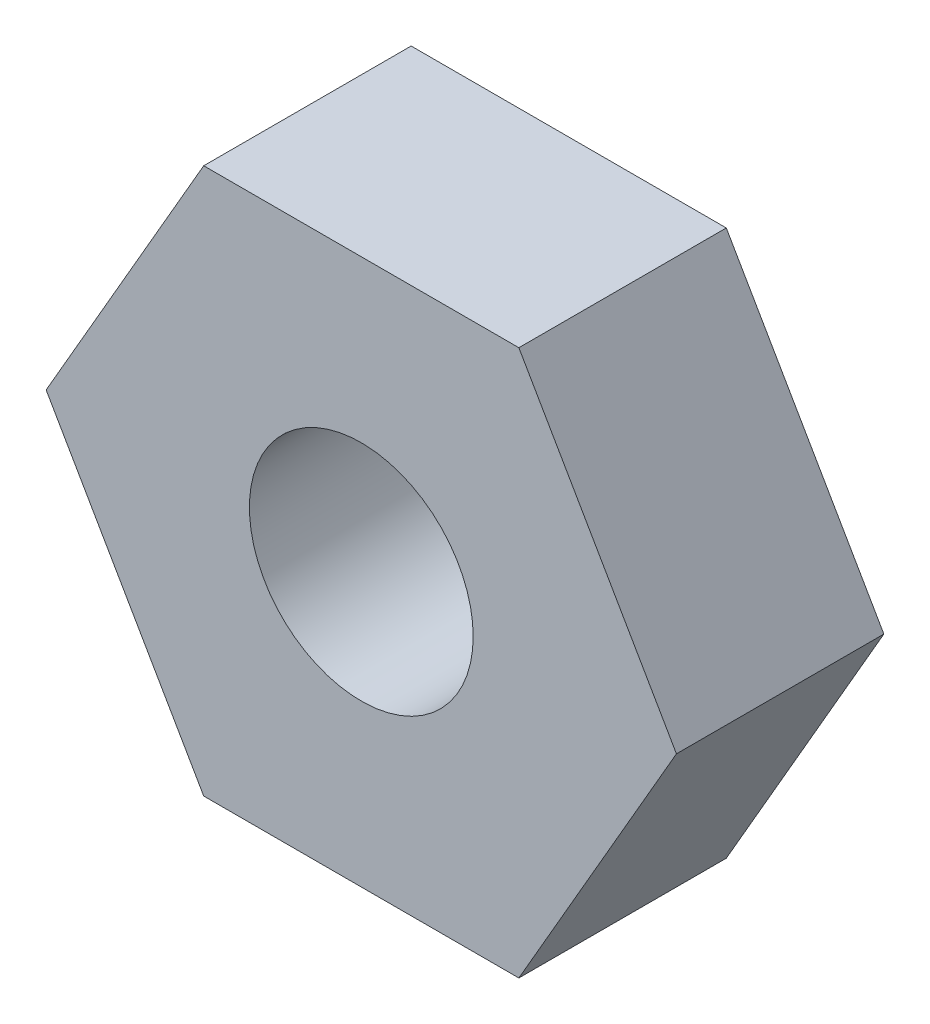
ISO-10303-21;
HEADER;
FILE_DESCRIPTION(('STEP AP214'),'2;1');
FILE_NAME('part.step','',(''),(''),'','','');
FILE_SCHEMA(('AUTOMOTIVE_DESIGN { 1 0 10303 214 1 1 1 1 }'));
ENDSEC;
DATA;
#1=APPLICATION_CONTEXT('core data for automotive mechanical design processes');
#2=APPLICATION_PROTOCOL_DEFINITION('international standard','automotive_design',2000,#1);
#3=PRODUCT_CONTEXT('',#1,'mechanical');
#4=PRODUCT('Part','Part','',(#3));
#5=PRODUCT_RELATED_PRODUCT_CATEGORY('part','',(#4));
#6=PRODUCT_DEFINITION_FORMATION('','',#4);
#7=PRODUCT_DEFINITION_CONTEXT('part definition',#1,'design');
#8=PRODUCT_DEFINITION('design','',#6,#7);
#9=PRODUCT_DEFINITION_SHAPE('','',#8);
#10=(LENGTH_UNIT() NAMED_UNIT(*) SI_UNIT(.MILLI.,.METRE.));
#11=(NAMED_UNIT(*) PLANE_ANGLE_UNIT() SI_UNIT($,.RADIAN.));
#12=(NAMED_UNIT(*) SI_UNIT($,.STERADIAN.) SOLID_ANGLE_UNIT());
#13=UNCERTAINTY_MEASURE_WITH_UNIT(LENGTH_MEASURE(1.E-05),#10,'distance_accuracy_value','');
#14=(GEOMETRIC_REPRESENTATION_CONTEXT(3) GLOBAL_UNCERTAINTY_ASSIGNED_CONTEXT((#13)) GLOBAL_UNIT_ASSIGNED_CONTEXT((#10,
#11,#12)) REPRESENTATION_CONTEXT('',''));
#15=CARTESIAN_POINT('',(0.,0.,0.));
#16=DIRECTION('',(0.,0.,1.));
#17=DIRECTION('',(1.,0.,0.));
#18=AXIS2_PLACEMENT_3D('',#15,#16,#17);
#19=CARTESIAN_POINT('',(-1.44337567297409,2.49999999999998,1.9));
#20=DIRECTION('',(0.866025403784441,-0.499999999999995,0.));
#21=DIRECTION('',(0.499999999999995,0.866025403784442,0.));
#22=AXIS2_PLACEMENT_3D('',#19,#20,#21);
#23=PLANE('',#22);
#24=DIRECTION('',(-0.499999999999995,-0.866025403784442,0.));
#25=VECTOR('',#24,1.);
#26=CARTESIAN_POINT('',(-1.44337567297409,2.49999999999998,0.));
#27=LINE('',#26,#25);
#28=CARTESIAN_POINT('',(-1.44337567297409,2.49999999999998,0.));
#29=VERTEX_POINT('',#28);
#30=CARTESIAN_POINT('',(-2.88675134594813,0.,0.));
#31=VERTEX_POINT('',#30);
#32=EDGE_CURVE('E125',#29,#31,#27,.T.);
#33=ORIENTED_EDGE('',*,*,#32,.T.);
#34=DIRECTION('',(0.,0.,-1.));
#35=VECTOR('',#34,1.);
#36=CARTESIAN_POINT('',(-2.88675134594813,0.,1.9));
#37=LINE('',#36,#35);
#38=CARTESIAN_POINT('',(-2.88675134594813,0.,1.9));
#39=VERTEX_POINT('',#38);
#40=EDGE_CURVE('E11',#39,#31,#37,.T.);
#41=ORIENTED_EDGE('',*,*,#40,.F.);
#42=DIRECTION('',(-0.499999999999995,-0.866025403784442,0.));
#43=VECTOR('',#42,1.);
#44=CARTESIAN_POINT('',(-1.44337567297409,2.49999999999998,1.9));
#45=LINE('',#44,#43);
#46=CARTESIAN_POINT('',(-1.44337567297409,2.49999999999998,1.9));
#47=VERTEX_POINT('',#46);
#48=EDGE_CURVE('E136',#47,#39,#45,.T.);
#49=ORIENTED_EDGE('',*,*,#48,.F.);
#50=DIRECTION('',(0.,0.,-1.));
#51=VECTOR('',#50,1.);
#52=CARTESIAN_POINT('',(-1.44337567297409,2.49999999999998,1.9));
#53=LINE('',#52,#51);
#54=EDGE_CURVE('E121',#47,#29,#53,.T.);
#55=ORIENTED_EDGE('',*,*,#54,.T.);
#56=EDGE_LOOP('',(#33,#41,#49,#55));
#57=FACE_BOUND('',#56,.T.);
#58=ADVANCED_FACE('F41',(#57),#23,.F.);
#59=CARTESIAN_POINT('',(-2.88675134594813,0.,1.9));
#60=DIRECTION('',(0.866025403784438,0.500000000000001,0.));
#61=DIRECTION('',(-0.500000000000001,0.866025403784438,0.));
#62=AXIS2_PLACEMENT_3D('',#59,#60,#61);
#63=PLANE('',#62);
#64=DIRECTION('',(0.500000000000001,-0.866025403784438,0.));
#65=VECTOR('',#64,1.);
#66=CARTESIAN_POINT('',(-2.88675134594813,0.,0.));
#67=LINE('',#66,#65);
#68=CARTESIAN_POINT('',(-1.44337567297406,-2.50000000000001,0.));
#69=VERTEX_POINT('',#68);
#70=EDGE_CURVE('E128',#31,#69,#67,.T.);
#71=ORIENTED_EDGE('',*,*,#70,.T.);
#72=DIRECTION('',(0.,0.,-1.));
#73=VECTOR('',#72,1.);
#74=CARTESIAN_POINT('',(-1.44337567297406,-2.50000000000001,1.9));
#75=LINE('',#74,#73);
#76=CARTESIAN_POINT('',(-1.44337567297406,-2.50000000000001,1.9));
#77=VERTEX_POINT('',#76);
#78=EDGE_CURVE('E49',#77,#69,#75,.T.);
#79=ORIENTED_EDGE('',*,*,#78,.F.);
#80=DIRECTION('',(0.500000000000001,-0.866025403784438,0.));
#81=VECTOR('',#80,1.);
#82=CARTESIAN_POINT('',(-2.88675134594813,0.,1.9));
#83=LINE('',#82,#81);
#84=EDGE_CURVE('E94',#39,#77,#83,.T.);
#85=ORIENTED_EDGE('',*,*,#84,.F.);
#86=ORIENTED_EDGE('',*,*,#40,.T.);
#87=EDGE_LOOP('',(#71,#79,#85,#86));
#88=FACE_BOUND('',#87,.T.);
#89=ADVANCED_FACE('F161',(#88),#63,.F.);
#90=CARTESIAN_POINT('',(-1.44337567297406,-2.50000000000001,1.9));
#91=DIRECTION('',(0.,1.,0.));
#92=DIRECTION('',(-1.,0.,0.));
#93=AXIS2_PLACEMENT_3D('',#90,#91,#92);
#94=PLANE('',#93);
#95=DIRECTION('',(1.,0.,0.));
#96=VECTOR('',#95,1.);
#97=CARTESIAN_POINT('',(-1.44337567297406,-2.50000000000001,0.));
#98=LINE('',#97,#96);
#99=CARTESIAN_POINT('',(1.44337567297408,-2.5,0.));
#100=VERTEX_POINT('',#99);
#101=EDGE_CURVE('E131',#69,#100,#98,.T.);
#102=ORIENTED_EDGE('',*,*,#101,.T.);
#103=DIRECTION('',(0.,0.,-1.));
#104=VECTOR('',#103,1.);
#105=CARTESIAN_POINT('',(1.44337567297408,-2.5,1.9));
#106=LINE('',#105,#104);
#107=CARTESIAN_POINT('',(1.44337567297408,-2.5,1.9));
#108=VERTEX_POINT('',#107);
#109=EDGE_CURVE('E116',#108,#100,#106,.T.);
#110=ORIENTED_EDGE('',*,*,#109,.F.);
#111=DIRECTION('',(1.,0.,0.));
#112=VECTOR('',#111,1.);
#113=CARTESIAN_POINT('',(-1.44337567297406,-2.50000000000001,1.9));
#114=LINE('',#113,#112);
#115=EDGE_CURVE('E107',#77,#108,#114,.T.);
#116=ORIENTED_EDGE('',*,*,#115,.F.);
#117=ORIENTED_EDGE('',*,*,#78,.T.);
#118=EDGE_LOOP('',(#102,#110,#116,#117));
#119=FACE_BOUND('',#118,.T.);
#120=ADVANCED_FACE('F142',(#119),#94,.F.);
#121=CARTESIAN_POINT('',(1.44337567297408,-2.5,1.9));
#122=DIRECTION('',(-0.866025403784442,0.499999999999995,0.));
#123=DIRECTION('',(-0.499999999999995,-0.866025403784442,0.));
#124=AXIS2_PLACEMENT_3D('',#121,#122,#123);
#125=PLANE('',#124);
#126=DIRECTION('',(0.499999999999995,0.866025403784442,0.));
#127=VECTOR('',#126,1.);
#128=CARTESIAN_POINT('',(1.44337567297408,-2.5,0.));
#129=LINE('',#128,#127);
#130=CARTESIAN_POINT('',(2.88675134594813,0.,0.));
#131=VERTEX_POINT('',#130);
#132=EDGE_CURVE('E115',#100,#131,#129,.T.);
#133=ORIENTED_EDGE('',*,*,#132,.T.);
#134=DIRECTION('',(0.,0.,-1.));
#135=VECTOR('',#134,1.);
#136=CARTESIAN_POINT('',(2.88675134594813,0.,1.9));
#137=LINE('',#136,#135);
#138=CARTESIAN_POINT('',(2.88675134594813,0.,1.9));
#139=VERTEX_POINT('',#138);
#140=EDGE_CURVE('E112',#139,#131,#137,.T.);
#141=ORIENTED_EDGE('',*,*,#140,.F.);
#142=DIRECTION('',(0.499999999999995,0.866025403784442,0.));
#143=VECTOR('',#142,1.);
#144=CARTESIAN_POINT('',(1.44337567297408,-2.5,1.9));
#145=LINE('',#144,#143);
#146=EDGE_CURVE('E101',#108,#139,#145,.T.);
#147=ORIENTED_EDGE('',*,*,#146,.F.);
#148=ORIENTED_EDGE('',*,*,#109,.T.);
#149=EDGE_LOOP('',(#133,#141,#147,#148));
#150=FACE_BOUND('',#149,.T.);
#151=ADVANCED_FACE('F113',(#150),#125,.F.);
#152=CARTESIAN_POINT('',(2.88675134594813,0.,1.9));
#153=DIRECTION('',(-0.866025403784435,-0.500000000000007,0.));
#154=DIRECTION('',(0.500000000000007,-0.866025403784435,0.));
#155=AXIS2_PLACEMENT_3D('',#152,#153,#154);
#156=PLANE('',#155);
#157=DIRECTION('',(-0.500000000000007,0.866025403784435,0.));
#158=VECTOR('',#157,1.);
#159=CARTESIAN_POINT('',(2.88675134594813,0.,0.));
#160=LINE('',#159,#158);
#161=CARTESIAN_POINT('',(1.44337567297404,2.50000000000002,0.));
#162=VERTEX_POINT('',#161);
#163=EDGE_CURVE('E80',#131,#162,#160,.T.);
#164=ORIENTED_EDGE('',*,*,#163,.T.);
#165=DIRECTION('',(0.,0.,-1.));
#166=VECTOR('',#165,1.);
#167=CARTESIAN_POINT('',(1.44337567297404,2.50000000000002,1.9));
#168=LINE('',#167,#166);
#169=CARTESIAN_POINT('',(1.44337567297404,2.50000000000002,1.9));
#170=VERTEX_POINT('',#169);
#171=EDGE_CURVE('E117',#170,#162,#168,.T.);
#172=ORIENTED_EDGE('',*,*,#171,.F.);
#173=DIRECTION('',(-0.500000000000007,0.866025403784435,0.));
#174=VECTOR('',#173,1.);
#175=CARTESIAN_POINT('',(2.88675134594813,0.,1.9));
#176=LINE('',#175,#174);
#177=EDGE_CURVE('E105',#139,#170,#176,.T.);
#178=ORIENTED_EDGE('',*,*,#177,.F.);
#179=ORIENTED_EDGE('',*,*,#140,.T.);
#180=EDGE_LOOP('',(#164,#172,#178,#179));
#181=FACE_BOUND('',#180,.T.);
#182=ADVANCED_FACE('F119',(#181),#156,.F.);
#183=CARTESIAN_POINT('',(1.44337567297404,2.50000000000002,1.9));
#184=DIRECTION('',(0.,-1.,0.));
#185=DIRECTION('',(1.,0.,0.));
#186=AXIS2_PLACEMENT_3D('',#183,#184,#185);
#187=PLANE('',#186);
#188=DIRECTION('',(-1.,0.,0.));
#189=VECTOR('',#188,1.);
#190=CARTESIAN_POINT('',(1.44337567297404,2.50000000000002,0.));
#191=LINE('',#190,#189);
#192=EDGE_CURVE('E86',#162,#29,#191,.T.);
#193=ORIENTED_EDGE('',*,*,#192,.T.);
#194=ORIENTED_EDGE('',*,*,#54,.F.);
#195=DIRECTION('',(-1.,0.,0.));
#196=VECTOR('',#195,1.);
#197=CARTESIAN_POINT('',(1.44337567297404,2.50000000000002,1.9));
#198=LINE('',#197,#196);
#199=EDGE_CURVE('E57',#170,#47,#198,.T.);
#200=ORIENTED_EDGE('',*,*,#199,.F.);
#201=ORIENTED_EDGE('',*,*,#171,.T.);
#202=EDGE_LOOP('',(#193,#194,#200,#201));
#203=FACE_BOUND('',#202,.T.);
#204=ADVANCED_FACE('F149',(#203),#187,.F.);
#205=CARTESIAN_POINT('',(0.,0.,1.9));
#206=DIRECTION('',(0.,0.,1.));
#207=DIRECTION('',(1.,0.,0.));
#208=AXIS2_PLACEMENT_3D('',#205,#206,#207);
#209=PLANE('',#208);
#210=CARTESIAN_POINT('',(0.,0.,1.9));
#211=DIRECTION('',(0.,0.,1.));
#212=DIRECTION('',(1.,0.,0.));
#213=AXIS2_PLACEMENT_3D('',#210,#211,#212);
#214=CIRCLE('',#213,1.025);
#215=CARTESIAN_POINT('',(1.025,0.,1.9));
#216=VERTEX_POINT('',#215);
#217=EDGE_CURVE('E221',#216,#216,#214,.T.);
#218=ORIENTED_EDGE('',*,*,#217,.F.);
#219=EDGE_LOOP('',(#218));
#220=FACE_BOUND('',#219,.T.);
#221=ORIENTED_EDGE('',*,*,#48,.T.);
#222=ORIENTED_EDGE('',*,*,#84,.T.);
#223=ORIENTED_EDGE('',*,*,#115,.T.);
#224=ORIENTED_EDGE('',*,*,#146,.T.);
#225=ORIENTED_EDGE('',*,*,#177,.T.);
#226=ORIENTED_EDGE('',*,*,#199,.T.);
#227=EDGE_LOOP('',(#221,#222,#223,#224,#225,#226));
#228=FACE_BOUND('',#227,.T.);
#229=ADVANCED_FACE('F103',(#220,#228),#209,.T.);
#230=CARTESIAN_POINT('',(0.,0.,0.));
#231=DIRECTION('',(0.,0.,1.));
#232=DIRECTION('',(1.,0.,0.));
#233=AXIS2_PLACEMENT_3D('',#230,#231,#232);
#234=PLANE('',#233);
#235=CARTESIAN_POINT('',(0.,0.,0.));
#236=DIRECTION('',(0.,0.,1.));
#237=DIRECTION('',(1.,0.,0.));
#238=AXIS2_PLACEMENT_3D('',#235,#236,#237);
#239=CIRCLE('',#238,1.025);
#240=CARTESIAN_POINT('',(1.025,0.,0.));
#241=VERTEX_POINT('',#240);
#242=EDGE_CURVE('E129',#241,#241,#239,.T.);
#243=ORIENTED_EDGE('',*,*,#242,.T.);
#244=EDGE_LOOP('',(#243));
#245=FACE_BOUND('',#244,.T.);
#246=ORIENTED_EDGE('',*,*,#32,.F.);
#247=ORIENTED_EDGE('',*,*,#192,.F.);
#248=ORIENTED_EDGE('',*,*,#163,.F.);
#249=ORIENTED_EDGE('',*,*,#132,.F.);
#250=ORIENTED_EDGE('',*,*,#101,.F.);
#251=ORIENTED_EDGE('',*,*,#70,.F.);
#252=EDGE_LOOP('',(#246,#247,#248,#249,#250,#251));
#253=FACE_BOUND('',#252,.T.);
#254=ADVANCED_FACE('F145',(#245,#253),#234,.F.);
#255=CARTESIAN_POINT('',(0.,0.,1.9));
#256=DIRECTION('',(0.,0.,1.));
#257=DIRECTION('',(1.,0.,0.));
#258=AXIS2_PLACEMENT_3D('',#255,#256,#257);
#259=CYLINDRICAL_SURFACE('',#258,1.025);
#260=ORIENTED_EDGE('',*,*,#242,.F.);
#261=EDGE_LOOP('',(#260));
#262=FACE_BOUND('',#261,.T.);
#263=ORIENTED_EDGE('',*,*,#217,.T.);
#264=EDGE_LOOP('',(#263));
#265=FACE_BOUND('',#264,.T.);
#266=ADVANCED_FACE('F200',(#262,#265),#259,.F.);
#267=CLOSED_SHELL('',(#58,#89,#120,#151,#182,#204,#229,#254,#266));
#268=MANIFOLD_SOLID_BREP('B2',#267);
#269=ADVANCED_BREP_SHAPE_REPRESENTATION('',(#18,#268),#14);
#270=SHAPE_DEFINITION_REPRESENTATION(#9,#269);
ENDSEC;
END-ISO-10303-21;
